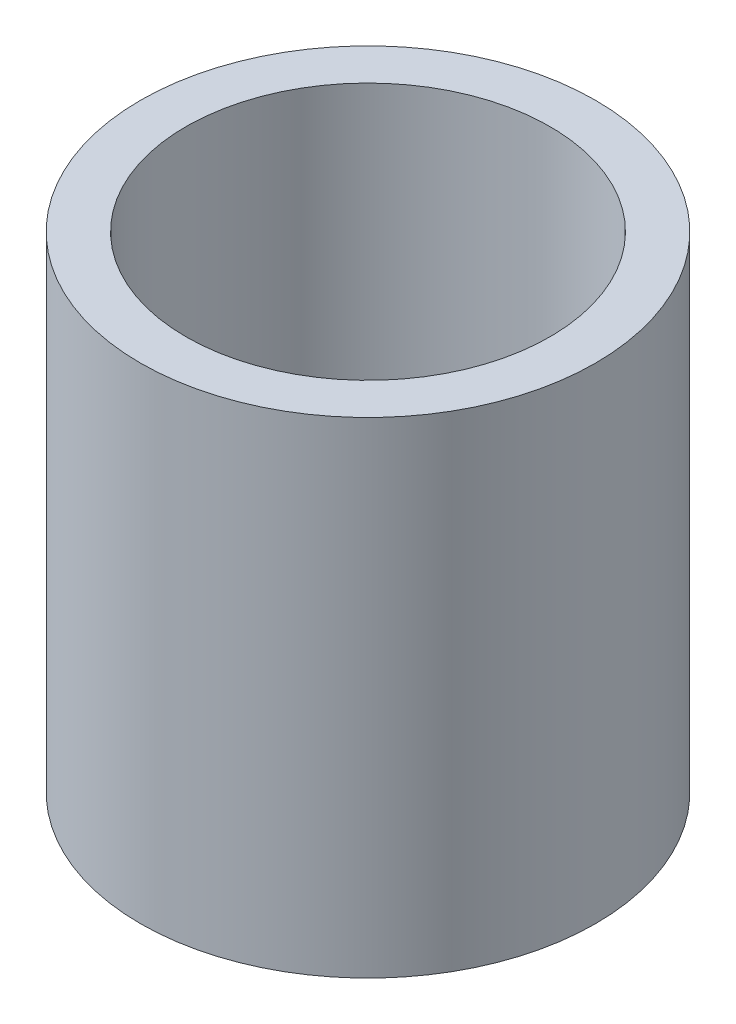
ISO-10303-21;
HEADER;
FILE_DESCRIPTION(('STEP AP214'),'2;1');
FILE_NAME('part.step','',(''),(''),'','','');
FILE_SCHEMA(('AUTOMOTIVE_DESIGN { 1 0 10303 214 1 1 1 1 }'));
ENDSEC;
DATA;
#1=APPLICATION_CONTEXT('core data for automotive mechanical design processes');
#2=APPLICATION_PROTOCOL_DEFINITION('international standard','automotive_design',2000,#1);
#3=PRODUCT_CONTEXT('',#1,'mechanical');
#4=PRODUCT('Part','Part','',(#3));
#5=PRODUCT_RELATED_PRODUCT_CATEGORY('part','',(#4));
#6=PRODUCT_DEFINITION_FORMATION('','',#4);
#7=PRODUCT_DEFINITION_CONTEXT('part definition',#1,'design');
#8=PRODUCT_DEFINITION('design','',#6,#7);
#9=PRODUCT_DEFINITION_SHAPE('','',#8);
#10=(LENGTH_UNIT() NAMED_UNIT(*) SI_UNIT(.MILLI.,.METRE.));
#11=(NAMED_UNIT(*) PLANE_ANGLE_UNIT() SI_UNIT($,.RADIAN.));
#12=(NAMED_UNIT(*) SI_UNIT($,.STERADIAN.) SOLID_ANGLE_UNIT());
#13=UNCERTAINTY_MEASURE_WITH_UNIT(LENGTH_MEASURE(1.E-05),#10,'distance_accuracy_value','');
#14=(GEOMETRIC_REPRESENTATION_CONTEXT(3) GLOBAL_UNCERTAINTY_ASSIGNED_CONTEXT((#13)) GLOBAL_UNIT_ASSIGNED_CONTEXT((#10,
#11,#12)) REPRESENTATION_CONTEXT('',''));
#15=CARTESIAN_POINT('',(0.,0.,0.));
#16=DIRECTION('',(0.,0.,1.));
#17=DIRECTION('',(1.,0.,0.));
#18=AXIS2_PLACEMENT_3D('',#15,#16,#17);
#19=CARTESIAN_POINT('',(0.,25.4,0.));
#20=DIRECTION('',(0.,1.,0.));
#21=DIRECTION('',(0.,0.,1.));
#22=AXIS2_PLACEMENT_3D('',#19,#20,#21);
#23=PLANE('',#22);
#24=CARTESIAN_POINT('',(0.,25.4,0.));
#25=DIRECTION('',(0.,1.,0.));
#26=DIRECTION('',(0.,0.,1.));
#27=AXIS2_PLACEMENT_3D('',#24,#25,#26);
#28=CIRCLE('',#27,11.90625);
#29=CARTESIAN_POINT('',(0.,25.4,11.90625));
#30=VERTEX_POINT('',#29);
#31=EDGE_CURVE('E10',#30,#30,#28,.T.);
#32=ORIENTED_EDGE('',*,*,#31,.T.);
#33=EDGE_LOOP('',(#32));
#34=FACE_BOUND('',#33,.T.);
#35=CARTESIAN_POINT('',(0.,25.4,0.));
#36=DIRECTION('',(0.,1.,0.));
#37=DIRECTION('',(0.,0.,1.));
#38=AXIS2_PLACEMENT_3D('',#35,#36,#37);
#39=CIRCLE('',#38,9.525);
#40=CARTESIAN_POINT('',(0.,25.4,9.525));
#41=VERTEX_POINT('',#40);
#42=EDGE_CURVE('E43',#41,#41,#39,.T.);
#43=ORIENTED_EDGE('',*,*,#42,.F.);
#44=EDGE_LOOP('',(#43));
#45=FACE_BOUND('',#44,.T.);
#46=ADVANCED_FACE('F32',(#34,#45),#23,.T.);
#47=CARTESIAN_POINT('',(0.,0.,0.));
#48=DIRECTION('',(0.,1.,0.));
#49=DIRECTION('',(0.,0.,1.));
#50=AXIS2_PLACEMENT_3D('',#47,#48,#49);
#51=PLANE('',#50);
#52=CARTESIAN_POINT('',(0.,0.,0.));
#53=DIRECTION('',(0.,1.,0.));
#54=DIRECTION('',(0.,0.,1.));
#55=AXIS2_PLACEMENT_3D('',#52,#53,#54);
#56=CIRCLE('',#55,11.90625);
#57=CARTESIAN_POINT('',(0.,0.,11.90625));
#58=VERTEX_POINT('',#57);
#59=EDGE_CURVE('E36',#58,#58,#56,.T.);
#60=ORIENTED_EDGE('',*,*,#59,.F.);
#61=EDGE_LOOP('',(#60));
#62=FACE_BOUND('',#61,.T.);
#63=CARTESIAN_POINT('',(0.,0.,0.));
#64=DIRECTION('',(0.,1.,0.));
#65=DIRECTION('',(0.,0.,1.));
#66=AXIS2_PLACEMENT_3D('',#63,#64,#65);
#67=CIRCLE('',#66,9.525);
#68=CARTESIAN_POINT('',(0.,0.,9.525));
#69=VERTEX_POINT('',#68);
#70=EDGE_CURVE('E45',#69,#69,#67,.T.);
#71=ORIENTED_EDGE('',*,*,#70,.T.);
#72=EDGE_LOOP('',(#71));
#73=FACE_BOUND('',#72,.T.);
#74=ADVANCED_FACE('F55',(#62,#73),#51,.F.);
#75=CARTESIAN_POINT('',(0.,25.4,0.));
#76=DIRECTION('',(0.,-1.,0.));
#77=DIRECTION('',(0.,0.,-1.));
#78=AXIS2_PLACEMENT_3D('',#75,#76,#77);
#79=CYLINDRICAL_SURFACE('',#78,11.90625);
#80=ORIENTED_EDGE('',*,*,#31,.F.);
#81=EDGE_LOOP('',(#80));
#82=FACE_BOUND('',#81,.T.);
#83=ORIENTED_EDGE('',*,*,#59,.T.);
#84=EDGE_LOOP('',(#83));
#85=FACE_BOUND('',#84,.T.);
#86=ADVANCED_FACE('F34',(#82,#85),#79,.T.);
#87=CARTESIAN_POINT('',(0.,25.4,0.));
#88=DIRECTION('',(0.,-1.,0.));
#89=DIRECTION('',(0.,0.,-1.));
#90=AXIS2_PLACEMENT_3D('',#87,#88,#89);
#91=CYLINDRICAL_SURFACE('',#90,9.525);
#92=ORIENTED_EDGE('',*,*,#42,.T.);
#93=EDGE_LOOP('',(#92));
#94=FACE_BOUND('',#93,.T.);
#95=ORIENTED_EDGE('',*,*,#70,.F.);
#96=EDGE_LOOP('',(#95));
#97=FACE_BOUND('',#96,.T.);
#98=ADVANCED_FACE('F51',(#94,#97),#91,.F.);
#99=CLOSED_SHELL('',(#46,#74,#86,#98));
#100=MANIFOLD_SOLID_BREP('B2',#99);
#101=ADVANCED_BREP_SHAPE_REPRESENTATION('',(#18,#100),#14);
#102=SHAPE_DEFINITION_REPRESENTATION(#9,#101);
ENDSEC;
END-ISO-10303-21;
